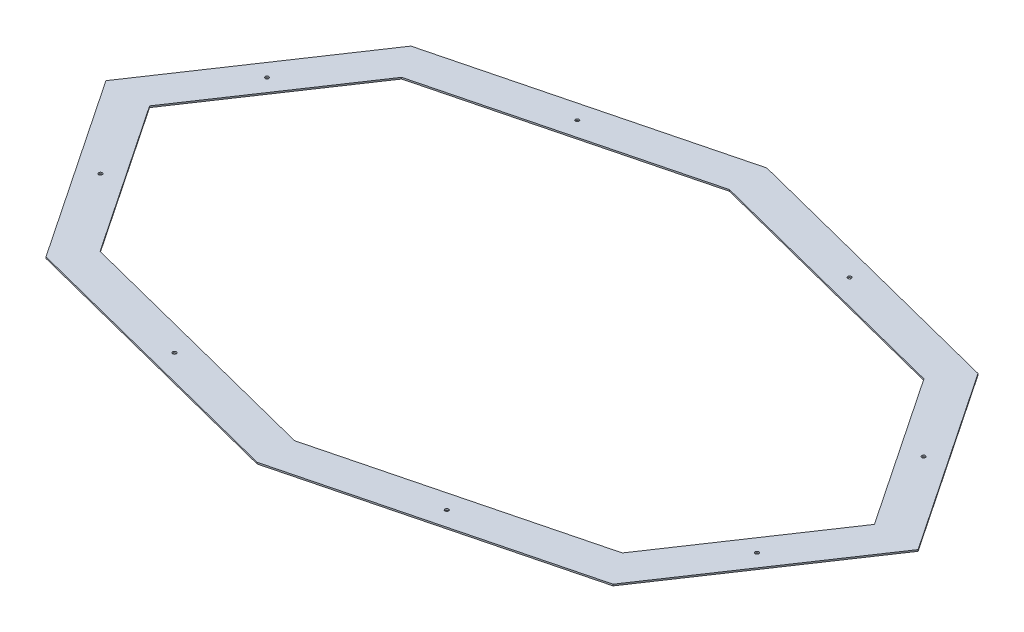
ISO-10303-21;
HEADER;
FILE_DESCRIPTION(('STEP AP214'),'2;1');
FILE_NAME('part.step','',(''),(''),'','','');
FILE_SCHEMA(('AUTOMOTIVE_DESIGN { 1 0 10303 214 1 1 1 1 }'));
ENDSEC;
DATA;
#1=APPLICATION_CONTEXT('core data for automotive mechanical design processes');
#2=APPLICATION_PROTOCOL_DEFINITION('international standard','automotive_design',2000,#1);
#3=PRODUCT_CONTEXT('',#1,'mechanical');
#4=PRODUCT('Part','Part','',(#3));
#5=PRODUCT_RELATED_PRODUCT_CATEGORY('part','',(#4));
#6=PRODUCT_DEFINITION_FORMATION('','',#4);
#7=PRODUCT_DEFINITION_CONTEXT('part definition',#1,'design');
#8=PRODUCT_DEFINITION('design','',#6,#7);
#9=PRODUCT_DEFINITION_SHAPE('','',#8);
#10=(LENGTH_UNIT() NAMED_UNIT(*) SI_UNIT(.MILLI.,.METRE.));
#11=(NAMED_UNIT(*) PLANE_ANGLE_UNIT() SI_UNIT($,.RADIAN.));
#12=(NAMED_UNIT(*) SI_UNIT($,.STERADIAN.) SOLID_ANGLE_UNIT());
#13=UNCERTAINTY_MEASURE_WITH_UNIT(LENGTH_MEASURE(1.E-05),#10,'distance_accuracy_value','');
#14=(GEOMETRIC_REPRESENTATION_CONTEXT(3) GLOBAL_UNCERTAINTY_ASSIGNED_CONTEXT((#13)) GLOBAL_UNIT_ASSIGNED_CONTEXT((#10,
#11,#12)) REPRESENTATION_CONTEXT('',''));
#15=CARTESIAN_POINT('',(0.,0.,0.));
#16=DIRECTION('',(0.,0.,1.));
#17=DIRECTION('',(1.,0.,0.));
#18=AXIS2_PLACEMENT_3D('',#15,#16,#17);
#19=CARTESIAN_POINT('',(0.,1.5875,0.));
#20=DIRECTION('',(0.,-1.,0.));
#21=DIRECTION('',(0.,0.,-1.));
#22=AXIS2_PLACEMENT_3D('',#19,#20,#21);
#23=PLANE('',#22);
#24=CARTESIAN_POINT('',(-286.298886633003,1.5875,423.425472391245));
#25=DIRECTION('',(0.,1.,0.));
#26=DIRECTION('',(0.,0.,1.));
#27=AXIS2_PLACEMENT_3D('',#24,#25,#26);
#28=CIRCLE('',#27,3.80999999999998);
#29=CARTESIAN_POINT('',(-286.298886633003,1.5875,427.235472391245));
#30=VERTEX_POINT('',#29);
#31=EDGE_CURVE('E399',#30,#30,#28,.T.);
#32=ORIENTED_EDGE('',*,*,#31,.F.);
#33=EDGE_LOOP('',(#32));
#34=FACE_BOUND('',#33,.T.);
#35=CARTESIAN_POINT('',(286.298886633004,1.5875,423.425472391245));
#36=DIRECTION('',(0.,1.,0.));
#37=DIRECTION('',(0.,0.,1.));
#38=AXIS2_PLACEMENT_3D('',#35,#36,#37);
#39=CIRCLE('',#38,3.80999999999998);
#40=CARTESIAN_POINT('',(286.298886633004,1.5875,427.235472391245));
#41=VERTEX_POINT('',#40);
#42=EDGE_CURVE('E401',#41,#41,#39,.T.);
#43=ORIENTED_EDGE('',*,*,#42,.F.);
#44=EDGE_LOOP('',(#43));
#45=FACE_BOUND('',#44,.T.);
#46=CARTESIAN_POINT('',(286.298886633003,1.5875,-423.425472391245));
#47=DIRECTION('',(0.,1.,0.));
#48=DIRECTION('',(0.,0.,1.));
#49=AXIS2_PLACEMENT_3D('',#46,#47,#48);
#50=CIRCLE('',#49,3.80999999999998);
#51=CARTESIAN_POINT('',(286.298886633003,1.5875,-419.615472391245));
#52=VERTEX_POINT('',#51);
#53=EDGE_CURVE('E409',#52,#52,#50,.T.);
#54=ORIENTED_EDGE('',*,*,#53,.F.);
#55=EDGE_LOOP('',(#54));
#56=FACE_BOUND('',#55,.T.);
#57=CARTESIAN_POINT('',(-286.298886633004,1.5875,-423.425472391246));
#58=DIRECTION('',(0.,1.,0.));
#59=DIRECTION('',(0.,0.,1.));
#60=AXIS2_PLACEMENT_3D('',#57,#58,#59);
#61=CIRCLE('',#60,3.80999999999998);
#62=CARTESIAN_POINT('',(-286.298886633004,1.5875,-419.615472391246));
#63=VERTEX_POINT('',#62);
#64=EDGE_CURVE('E415',#63,#63,#61,.T.);
#65=ORIENTED_EDGE('',*,*,#64,.F.);
#66=EDGE_LOOP('',(#65));
#67=FACE_BOUND('',#66,.T.);
#68=CARTESIAN_POINT('',(-690.246932704836,1.5875,-175.164374230963));
#69=DIRECTION('',(0.,1.,0.));
#70=DIRECTION('',(0.,0.,1.));
#71=AXIS2_PLACEMENT_3D('',#68,#69,#70);
#72=CIRCLE('',#71,3.80999999999998);
#73=CARTESIAN_POINT('',(-690.246932704836,1.5875,-171.354374230964));
#74=VERTEX_POINT('',#73);
#75=EDGE_CURVE('E421',#74,#74,#72,.T.);
#76=ORIENTED_EDGE('',*,*,#75,.F.);
#77=EDGE_LOOP('',(#76));
#78=FACE_BOUND('',#77,.T.);
#79=CARTESIAN_POINT('',(-690.246932704836,1.5875,175.164374230963));
#80=DIRECTION('',(0.,1.,0.));
#81=DIRECTION('',(0.,0.,1.));
#82=AXIS2_PLACEMENT_3D('',#79,#80,#81);
#83=CIRCLE('',#82,3.80999999999998);
#84=CARTESIAN_POINT('',(-690.246932704836,1.5875,178.974374230963));
#85=VERTEX_POINT('',#84);
#86=EDGE_CURVE('E427',#85,#85,#83,.T.);
#87=ORIENTED_EDGE('',*,*,#86,.F.);
#88=EDGE_LOOP('',(#87));
#89=FACE_BOUND('',#88,.T.);
#90=CARTESIAN_POINT('',(690.246932704837,1.5875,175.164374230964));
#91=DIRECTION('',(0.,1.,0.));
#92=DIRECTION('',(0.,0.,1.));
#93=AXIS2_PLACEMENT_3D('',#90,#91,#92);
#94=CIRCLE('',#93,3.80999999999998);
#95=CARTESIAN_POINT('',(690.246932704837,1.5875,178.974374230964));
#96=VERTEX_POINT('',#95);
#97=EDGE_CURVE('E433',#96,#96,#94,.T.);
#98=ORIENTED_EDGE('',*,*,#97,.F.);
#99=EDGE_LOOP('',(#98));
#100=FACE_BOUND('',#99,.T.);
#101=CARTESIAN_POINT('',(690.246932704837,1.5875,-175.164374230963));
#102=DIRECTION('',(0.,1.,0.));
#103=DIRECTION('',(0.,0.,1.));
#104=AXIS2_PLACEMENT_3D('',#101,#102,#103);
#105=CIRCLE('',#104,3.80999999999998);
#106=CARTESIAN_POINT('',(690.246932704837,1.5875,-171.354374230963));
#107=VERTEX_POINT('',#106);
#108=EDGE_CURVE('E439',#107,#107,#105,.T.);
#109=ORIENTED_EDGE('',*,*,#108,.F.);
#110=EDGE_LOOP('',(#109));
#111=FACE_BOUND('',#110,.T.);
#112=DIRECTION('',(-0.557560904059293,0.,0.830136035999272));
#113=VECTOR('',#112,1.);
#114=CARTESIAN_POINT('',(-853.792184287332,1.5875,-2.15105711021124E-13));
#115=LINE('',#114,#113);
#116=CARTESIAN_POINT('',(-596.116107134367,1.5875,-383.646334781136));
#117=VERTEX_POINT('',#116);
#118=CARTESIAN_POINT('',(-853.792184287332,1.5875,-2.15105711021124E-13));
#119=VERTEX_POINT('',#118);
#120=EDGE_CURVE('E215',#117,#119,#115,.T.);
#121=ORIENTED_EDGE('',*,*,#120,.T.);
#122=DIRECTION('',(0.557560904059292,0.,0.830136035999272));
#123=VECTOR('',#122,1.);
#124=CARTESIAN_POINT('',(-853.792184287332,1.5875,-2.15105711021124E-13));
#125=LINE('',#124,#123);
#126=CARTESIAN_POINT('',(-596.116107134367,1.5875,383.646334781137));
#127=VERTEX_POINT('',#126);
#128=EDGE_CURVE('E218',#119,#127,#125,.T.);
#129=ORIENTED_EDGE('',*,*,#128,.T.);
#130=DIRECTION('',(0.968918411611585,0.,0.247380499716696));
#131=VECTOR('',#130,1.);
#132=CARTESIAN_POINT('',(-1.90819582357449E-13,1.5875,535.844392641128));
#133=LINE('',#132,#131);
#134=CARTESIAN_POINT('',(-1.90819582357449E-13,1.5875,535.844392641128));
#135=VERTEX_POINT('',#134);
#136=EDGE_CURVE('E221',#127,#135,#133,.T.);
#137=ORIENTED_EDGE('',*,*,#136,.T.);
#138=DIRECTION('',(0.968918411611586,0.,-0.247380499716696));
#139=VECTOR('',#138,1.);
#140=CARTESIAN_POINT('',(596.116107134367,1.5875,383.646334781136));
#141=LINE('',#140,#139);
#142=CARTESIAN_POINT('',(596.116107134367,1.5875,383.646334781136));
#143=VERTEX_POINT('',#142);
#144=EDGE_CURVE('E223',#135,#143,#141,.T.);
#145=ORIENTED_EDGE('',*,*,#144,.T.);
#146=DIRECTION('',(0.557560904059293,0.,-0.830136035999272));
#147=VECTOR('',#146,1.);
#148=CARTESIAN_POINT('',(853.792184287331,1.5875,1.31838984174237E-13));
#149=LINE('',#148,#147);
#150=CARTESIAN_POINT('',(853.792184287331,1.5875,1.31838984174237E-13));
#151=VERTEX_POINT('',#150);
#152=EDGE_CURVE('E225',#143,#151,#149,.T.);
#153=ORIENTED_EDGE('',*,*,#152,.T.);
#154=DIRECTION('',(-0.557560904059293,0.,-0.830136035999272));
#155=VECTOR('',#154,1.);
#156=CARTESIAN_POINT('',(596.116107134367,1.5875,-383.646334781136));
#157=LINE('',#156,#155);
#158=CARTESIAN_POINT('',(596.116107134367,1.5875,-383.646334781136));
#159=VERTEX_POINT('',#158);
#160=EDGE_CURVE('E227',#151,#159,#157,.T.);
#161=ORIENTED_EDGE('',*,*,#160,.T.);
#162=DIRECTION('',(-0.968918411611585,0.,-0.247380499716696));
#163=VECTOR('',#162,1.);
#164=CARTESIAN_POINT('',(1.59594559789866E-13,1.5875,-535.844392641128));
#165=LINE('',#164,#163);
#166=CARTESIAN_POINT('',(1.59594559789866E-13,1.5875,-535.844392641128));
#167=VERTEX_POINT('',#166);
#168=EDGE_CURVE('E229',#159,#167,#165,.T.);
#169=ORIENTED_EDGE('',*,*,#168,.T.);
#170=DIRECTION('',(-0.968918411611585,0.,0.247380499716696));
#171=VECTOR('',#170,1.);
#172=CARTESIAN_POINT('',(-596.116107134367,1.5875,-383.646334781136));
#173=LINE('',#172,#171);
#174=EDGE_CURVE('E231',#167,#117,#173,.T.);
#175=ORIENTED_EDGE('',*,*,#174,.T.);
#176=EDGE_LOOP('',(#121,#129,#137,#145,#153,#161,#169,#175));
#177=FACE_BOUND('',#176,.T.);
#178=DIRECTION('',(-0.968918411611585,0.,0.247380499716696));
#179=VECTOR('',#178,1.);
#180=CARTESIAN_POINT('',(-549.079439397647,1.5875,-317.011162142716));
#181=LINE('',#180,#179);
#182=CARTESIAN_POINT('',(0.,1.5875,-457.2));
#183=VERTEX_POINT('',#182);
#184=CARTESIAN_POINT('',(-549.079439397647,1.5875,-317.011162142716));
#185=VERTEX_POINT('',#184);
#186=EDGE_CURVE('E148',#183,#185,#181,.T.);
#187=ORIENTED_EDGE('',*,*,#186,.F.);
#188=DIRECTION('',(-0.968918411611586,0.,-0.247380499716696));
#189=VECTOR('',#188,1.);
#190=CARTESIAN_POINT('',(0.,1.5875,-457.2));
#191=LINE('',#190,#189);
#192=CARTESIAN_POINT('',(549.079439397648,1.5875,-317.011162142716));
#193=VERTEX_POINT('',#192);
#194=EDGE_CURVE('E182',#193,#183,#191,.T.);
#195=ORIENTED_EDGE('',*,*,#194,.F.);
#196=DIRECTION('',(-0.557560904059292,0.,-0.830136035999272));
#197=VECTOR('',#196,1.);
#198=CARTESIAN_POINT('',(549.079439397648,1.5875,-317.011162142716));
#199=LINE('',#198,#197);
#200=CARTESIAN_POINT('',(762.,1.5875,0.));
#201=VERTEX_POINT('',#200);
#202=EDGE_CURVE('E180',#201,#193,#199,.T.);
#203=ORIENTED_EDGE('',*,*,#202,.F.);
#204=DIRECTION('',(0.557560904059292,0.,-0.830136035999272));
#205=VECTOR('',#204,1.);
#206=CARTESIAN_POINT('',(762.,1.5875,0.));
#207=LINE('',#206,#205);
#208=CARTESIAN_POINT('',(549.079439397648,1.5875,317.011162142716));
#209=VERTEX_POINT('',#208);
#210=EDGE_CURVE('E178',#209,#201,#207,.T.);
#211=ORIENTED_EDGE('',*,*,#210,.F.);
#212=DIRECTION('',(0.968918411611586,0.,-0.247380499716696));
#213=VECTOR('',#212,1.);
#214=CARTESIAN_POINT('',(549.079439397648,1.5875,317.011162142716));
#215=LINE('',#214,#213);
#216=CARTESIAN_POINT('',(0.,1.5875,457.2));
#217=VERTEX_POINT('',#216);
#218=EDGE_CURVE('E176',#217,#209,#215,.T.);
#219=ORIENTED_EDGE('',*,*,#218,.F.);
#220=DIRECTION('',(0.968918411611585,0.,0.247380499716696));
#221=VECTOR('',#220,1.);
#222=CARTESIAN_POINT('',(0.,1.5875,457.2));
#223=LINE('',#222,#221);
#224=CARTESIAN_POINT('',(-549.079439397647,1.5875,317.011162142716));
#225=VERTEX_POINT('',#224);
#226=EDGE_CURVE('E171',#225,#217,#223,.T.);
#227=ORIENTED_EDGE('',*,*,#226,.F.);
#228=DIRECTION('',(0.557560904059293,0.,0.830136035999271));
#229=VECTOR('',#228,1.);
#230=CARTESIAN_POINT('',(-762.,1.5875,0.));
#231=LINE('',#230,#229);
#232=CARTESIAN_POINT('',(-762.,1.5875,0.));
#233=VERTEX_POINT('',#232);
#234=EDGE_CURVE('E169',#233,#225,#231,.T.);
#235=ORIENTED_EDGE('',*,*,#234,.F.);
#236=DIRECTION('',(-0.557560904059293,0.,0.830136035999272));
#237=VECTOR('',#236,1.);
#238=CARTESIAN_POINT('',(-762.,1.5875,0.));
#239=LINE('',#238,#237);
#240=EDGE_CURVE('E156',#185,#233,#239,.T.);
#241=ORIENTED_EDGE('',*,*,#240,.F.);
#242=EDGE_LOOP('',(#187,#195,#203,#211,#219,#227,#235,#241));
#243=FACE_BOUND('',#242,.T.);
#244=ADVANCED_FACE('F35',(#34,#45,#56,#67,#78,#89,#100,#111,#177,#243),#23,.F.);
#245=CARTESIAN_POINT('',(0.,-1.5875,0.));
#246=DIRECTION('',(0.,-1.,0.));
#247=DIRECTION('',(0.,0.,-1.));
#248=AXIS2_PLACEMENT_3D('',#245,#246,#247);
#249=PLANE('',#248);
#250=CARTESIAN_POINT('',(-286.298886633003,-1.5875,423.425472391245));
#251=DIRECTION('',(0.,1.,0.));
#252=DIRECTION('',(0.,0.,1.));
#253=AXIS2_PLACEMENT_3D('',#250,#251,#252);
#254=CIRCLE('',#253,3.80999999999998);
#255=CARTESIAN_POINT('',(-286.298886633003,-1.5875,427.235472391245));
#256=VERTEX_POINT('',#255);
#257=EDGE_CURVE('E397',#256,#256,#254,.T.);
#258=ORIENTED_EDGE('',*,*,#257,.T.);
#259=EDGE_LOOP('',(#258));
#260=FACE_BOUND('',#259,.T.);
#261=CARTESIAN_POINT('',(286.298886633004,-1.5875,423.425472391245));
#262=DIRECTION('',(0.,1.,0.));
#263=DIRECTION('',(0.,0.,1.));
#264=AXIS2_PLACEMENT_3D('',#261,#262,#263);
#265=CIRCLE('',#264,3.80999999999998);
#266=CARTESIAN_POINT('',(286.298886633004,-1.5875,427.235472391245));
#267=VERTEX_POINT('',#266);
#268=EDGE_CURVE('E406',#267,#267,#265,.T.);
#269=ORIENTED_EDGE('',*,*,#268,.T.);
#270=EDGE_LOOP('',(#269));
#271=FACE_BOUND('',#270,.T.);
#272=CARTESIAN_POINT('',(286.298886633003,-1.5875,-423.425472391245));
#273=DIRECTION('',(0.,1.,0.));
#274=DIRECTION('',(0.,0.,1.));
#275=AXIS2_PLACEMENT_3D('',#272,#273,#274);
#276=CIRCLE('',#275,3.80999999999998);
#277=CARTESIAN_POINT('',(286.298886633003,-1.5875,-419.615472391245));
#278=VERTEX_POINT('',#277);
#279=EDGE_CURVE('E412',#278,#278,#276,.T.);
#280=ORIENTED_EDGE('',*,*,#279,.T.);
#281=EDGE_LOOP('',(#280));
#282=FACE_BOUND('',#281,.T.);
#283=CARTESIAN_POINT('',(-286.298886633004,-1.5875,-423.425472391246));
#284=DIRECTION('',(0.,1.,0.));
#285=DIRECTION('',(0.,0.,1.));
#286=AXIS2_PLACEMENT_3D('',#283,#284,#285);
#287=CIRCLE('',#286,3.80999999999998);
#288=CARTESIAN_POINT('',(-286.298886633004,-1.5875,-419.615472391246));
#289=VERTEX_POINT('',#288);
#290=EDGE_CURVE('E418',#289,#289,#287,.T.);
#291=ORIENTED_EDGE('',*,*,#290,.T.);
#292=EDGE_LOOP('',(#291));
#293=FACE_BOUND('',#292,.T.);
#294=CARTESIAN_POINT('',(-690.246932704836,-1.5875,-175.164374230963));
#295=DIRECTION('',(0.,1.,0.));
#296=DIRECTION('',(0.,0.,1.));
#297=AXIS2_PLACEMENT_3D('',#294,#295,#296);
#298=CIRCLE('',#297,3.80999999999998);
#299=CARTESIAN_POINT('',(-690.246932704836,-1.5875,-171.354374230964));
#300=VERTEX_POINT('',#299);
#301=EDGE_CURVE('E424',#300,#300,#298,.T.);
#302=ORIENTED_EDGE('',*,*,#301,.T.);
#303=EDGE_LOOP('',(#302));
#304=FACE_BOUND('',#303,.T.);
#305=CARTESIAN_POINT('',(-690.246932704836,-1.5875,175.164374230963));
#306=DIRECTION('',(0.,1.,0.));
#307=DIRECTION('',(0.,0.,1.));
#308=AXIS2_PLACEMENT_3D('',#305,#306,#307);
#309=CIRCLE('',#308,3.80999999999998);
#310=CARTESIAN_POINT('',(-690.246932704836,-1.5875,178.974374230963));
#311=VERTEX_POINT('',#310);
#312=EDGE_CURVE('E430',#311,#311,#309,.T.);
#313=ORIENTED_EDGE('',*,*,#312,.T.);
#314=EDGE_LOOP('',(#313));
#315=FACE_BOUND('',#314,.T.);
#316=CARTESIAN_POINT('',(690.246932704837,-1.5875,175.164374230964));
#317=DIRECTION('',(0.,1.,0.));
#318=DIRECTION('',(0.,0.,1.));
#319=AXIS2_PLACEMENT_3D('',#316,#317,#318);
#320=CIRCLE('',#319,3.80999999999998);
#321=CARTESIAN_POINT('',(690.246932704837,-1.5875,178.974374230964));
#322=VERTEX_POINT('',#321);
#323=EDGE_CURVE('E436',#322,#322,#320,.T.);
#324=ORIENTED_EDGE('',*,*,#323,.T.);
#325=EDGE_LOOP('',(#324));
#326=FACE_BOUND('',#325,.T.);
#327=CARTESIAN_POINT('',(690.246932704837,-1.5875,-175.164374230963));
#328=DIRECTION('',(0.,1.,0.));
#329=DIRECTION('',(0.,0.,1.));
#330=AXIS2_PLACEMENT_3D('',#327,#328,#329);
#331=CIRCLE('',#330,3.80999999999998);
#332=CARTESIAN_POINT('',(690.246932704837,-1.5875,-171.354374230963));
#333=VERTEX_POINT('',#332);
#334=EDGE_CURVE('E185',#333,#333,#331,.T.);
#335=ORIENTED_EDGE('',*,*,#334,.T.);
#336=EDGE_LOOP('',(#335));
#337=FACE_BOUND('',#336,.T.);
#338=DIRECTION('',(-0.557560904059293,0.,0.830136035999272));
#339=VECTOR('',#338,1.);
#340=CARTESIAN_POINT('',(-853.792184287332,-1.5875,-2.15105711021124E-13));
#341=LINE('',#340,#339);
#342=CARTESIAN_POINT('',(-596.116107134367,-1.5875,-383.646334781136));
#343=VERTEX_POINT('',#342);
#344=CARTESIAN_POINT('',(-853.792184287332,-1.5875,-2.15105711021124E-13));
#345=VERTEX_POINT('',#344);
#346=EDGE_CURVE('E164',#343,#345,#341,.T.);
#347=ORIENTED_EDGE('',*,*,#346,.F.);
#348=DIRECTION('',(-0.968918411611585,0.,0.247380499716696));
#349=VECTOR('',#348,1.);
#350=CARTESIAN_POINT('',(-596.116107134367,-1.5875,-383.646334781136));
#351=LINE('',#350,#349);
#352=CARTESIAN_POINT('',(1.59594559789866E-13,-1.5875,-535.844392641128));
#353=VERTEX_POINT('',#352);
#354=EDGE_CURVE('E219',#353,#343,#351,.T.);
#355=ORIENTED_EDGE('',*,*,#354,.F.);
#356=DIRECTION('',(-0.968918411611585,0.,-0.247380499716696));
#357=VECTOR('',#356,1.);
#358=CARTESIAN_POINT('',(1.59594559789866E-13,-1.5875,-535.844392641128));
#359=LINE('',#358,#357);
#360=CARTESIAN_POINT('',(596.116107134367,-1.5875,-383.646334781136));
#361=VERTEX_POINT('',#360);
#362=EDGE_CURVE('E246',#361,#353,#359,.T.);
#363=ORIENTED_EDGE('',*,*,#362,.F.);
#364=DIRECTION('',(-0.557560904059293,0.,-0.830136035999272));
#365=VECTOR('',#364,1.);
#366=CARTESIAN_POINT('',(596.116107134367,-1.5875,-383.646334781136));
#367=LINE('',#366,#365);
#368=CARTESIAN_POINT('',(853.792184287331,-1.5875,1.31838984174237E-13));
#369=VERTEX_POINT('',#368);
#370=EDGE_CURVE('E244',#369,#361,#367,.T.);
#371=ORIENTED_EDGE('',*,*,#370,.F.);
#372=DIRECTION('',(0.557560904059293,0.,-0.830136035999272));
#373=VECTOR('',#372,1.);
#374=CARTESIAN_POINT('',(853.792184287331,-1.5875,1.31838984174237E-13));
#375=LINE('',#374,#373);
#376=CARTESIAN_POINT('',(596.116107134367,-1.5875,383.646334781136));
#377=VERTEX_POINT('',#376);
#378=EDGE_CURVE('E242',#377,#369,#375,.T.);
#379=ORIENTED_EDGE('',*,*,#378,.F.);
#380=DIRECTION('',(0.968918411611586,0.,-0.247380499716696));
#381=VECTOR('',#380,1.);
#382=CARTESIAN_POINT('',(596.116107134367,-1.5875,383.646334781136));
#383=LINE('',#382,#381);
#384=CARTESIAN_POINT('',(-1.90819582357449E-13,-1.5875,535.844392641128));
#385=VERTEX_POINT('',#384);
#386=EDGE_CURVE('E240',#385,#377,#383,.T.);
#387=ORIENTED_EDGE('',*,*,#386,.F.);
#388=DIRECTION('',(0.968918411611585,0.,0.247380499716696));
#389=VECTOR('',#388,1.);
#390=CARTESIAN_POINT('',(-1.90819582357449E-13,-1.5875,535.844392641128));
#391=LINE('',#390,#389);
#392=CARTESIAN_POINT('',(-596.116107134367,-1.5875,383.646334781137));
#393=VERTEX_POINT('',#392);
#394=EDGE_CURVE('E238',#393,#385,#391,.T.);
#395=ORIENTED_EDGE('',*,*,#394,.F.);
#396=DIRECTION('',(0.557560904059292,0.,0.830136035999272));
#397=VECTOR('',#396,1.);
#398=CARTESIAN_POINT('',(-853.792184287332,-1.5875,-2.15105711021124E-13));
#399=LINE('',#398,#397);
#400=EDGE_CURVE('E236',#345,#393,#399,.T.);
#401=ORIENTED_EDGE('',*,*,#400,.F.);
#402=EDGE_LOOP('',(#347,#355,#363,#371,#379,#387,#395,#401));
#403=FACE_BOUND('',#402,.T.);
#404=DIRECTION('',(-0.968918411611586,0.,-0.247380499716696));
#405=VECTOR('',#404,1.);
#406=CARTESIAN_POINT('',(0.,-1.5875,-457.2));
#407=LINE('',#406,#405);
#408=CARTESIAN_POINT('',(549.079439397648,-1.5875,-317.011162142716));
#409=VERTEX_POINT('',#408);
#410=CARTESIAN_POINT('',(0.,-1.5875,-457.2));
#411=VERTEX_POINT('',#410);
#412=EDGE_CURVE('E157',#409,#411,#407,.T.);
#413=ORIENTED_EDGE('',*,*,#412,.T.);
#414=DIRECTION('',(-0.968918411611585,0.,0.247380499716696));
#415=VECTOR('',#414,1.);
#416=CARTESIAN_POINT('',(-549.079439397647,-1.5875,-317.011162142716));
#417=LINE('',#416,#415);
#418=CARTESIAN_POINT('',(-549.079439397647,-1.5875,-317.011162142716));
#419=VERTEX_POINT('',#418);
#420=EDGE_CURVE('E58',#411,#419,#417,.T.);
#421=ORIENTED_EDGE('',*,*,#420,.T.);
#422=DIRECTION('',(-0.557560904059293,0.,0.830136035999272));
#423=VECTOR('',#422,1.);
#424=CARTESIAN_POINT('',(-762.,-1.5875,0.));
#425=LINE('',#424,#423);
#426=CARTESIAN_POINT('',(-762.,-1.5875,0.));
#427=VERTEX_POINT('',#426);
#428=EDGE_CURVE('E163',#419,#427,#425,.T.);
#429=ORIENTED_EDGE('',*,*,#428,.T.);
#430=DIRECTION('',(0.557560904059293,0.,0.830136035999271));
#431=VECTOR('',#430,1.);
#432=CARTESIAN_POINT('',(-762.,-1.5875,0.));
#433=LINE('',#432,#431);
#434=CARTESIAN_POINT('',(-549.079439397647,-1.5875,317.011162142716));
#435=VERTEX_POINT('',#434);
#436=EDGE_CURVE('E187',#427,#435,#433,.T.);
#437=ORIENTED_EDGE('',*,*,#436,.T.);
#438=DIRECTION('',(0.968918411611585,0.,0.247380499716696));
#439=VECTOR('',#438,1.);
#440=CARTESIAN_POINT('',(0.,-1.5875,457.2));
#441=LINE('',#440,#439);
#442=CARTESIAN_POINT('',(0.,-1.5875,457.2));
#443=VERTEX_POINT('',#442);
#444=EDGE_CURVE('E190',#435,#443,#441,.T.);
#445=ORIENTED_EDGE('',*,*,#444,.T.);
#446=DIRECTION('',(0.968918411611586,0.,-0.247380499716696));
#447=VECTOR('',#446,1.);
#448=CARTESIAN_POINT('',(549.079439397648,-1.5875,317.011162142716));
#449=LINE('',#448,#447);
#450=CARTESIAN_POINT('',(549.079439397648,-1.5875,317.011162142716));
#451=VERTEX_POINT('',#450);
#452=EDGE_CURVE('E193',#443,#451,#449,.T.);
#453=ORIENTED_EDGE('',*,*,#452,.T.);
#454=DIRECTION('',(0.557560904059292,0.,-0.830136035999272));
#455=VECTOR('',#454,1.);
#456=CARTESIAN_POINT('',(762.,-1.5875,0.));
#457=LINE('',#456,#455);
#458=CARTESIAN_POINT('',(762.,-1.5875,0.));
#459=VERTEX_POINT('',#458);
#460=EDGE_CURVE('E196',#451,#459,#457,.T.);
#461=ORIENTED_EDGE('',*,*,#460,.T.);
#462=DIRECTION('',(-0.557560904059292,0.,-0.830136035999272));
#463=VECTOR('',#462,1.);
#464=CARTESIAN_POINT('',(549.079439397648,-1.5875,-317.011162142716));
#465=LINE('',#464,#463);
#466=EDGE_CURVE('E199',#459,#409,#465,.T.);
#467=ORIENTED_EDGE('',*,*,#466,.T.);
#468=EDGE_LOOP('',(#413,#421,#429,#437,#445,#453,#461,#467));
#469=FACE_BOUND('',#468,.T.);
#470=ADVANCED_FACE('F276',(#260,#271,#282,#293,#304,#315,#326,#337,#403,#469),#249,.T.);
#471=CARTESIAN_POINT('',(-853.792184287332,1.5875,-2.15105711021124E-13));
#472=DIRECTION('',(0.830136035999272,0.,0.557560904059293));
#473=DIRECTION('',(0.557560904059293,0.,-0.830136035999272));
#474=AXIS2_PLACEMENT_3D('',#471,#472,#473);
#475=PLANE('',#474);
#476=ORIENTED_EDGE('',*,*,#346,.T.);
#477=DIRECTION('',(0.,-1.,0.));
#478=VECTOR('',#477,1.);
#479=CARTESIAN_POINT('',(-853.792184287332,1.5875,-2.15105711021124E-13));
#480=LINE('',#479,#478);
#481=EDGE_CURVE('E11',#119,#345,#480,.T.);
#482=ORIENTED_EDGE('',*,*,#481,.F.);
#483=ORIENTED_EDGE('',*,*,#120,.F.);
#484=DIRECTION('',(0.,-1.,0.));
#485=VECTOR('',#484,1.);
#486=CARTESIAN_POINT('',(-596.116107134367,1.5875,-383.646334781136));
#487=LINE('',#486,#485);
#488=EDGE_CURVE('E233',#117,#343,#487,.T.);
#489=ORIENTED_EDGE('',*,*,#488,.T.);
#490=EDGE_LOOP('',(#476,#482,#483,#489));
#491=FACE_BOUND('',#490,.T.);
#492=ADVANCED_FACE('F37',(#491),#475,.F.);
#493=CARTESIAN_POINT('',(-853.792184287332,1.5875,-2.15105711021124E-13));
#494=DIRECTION('',(0.830136035999272,0.,-0.557560904059292));
#495=DIRECTION('',(-0.557560904059292,0.,-0.830136035999272));
#496=AXIS2_PLACEMENT_3D('',#493,#494,#495);
#497=PLANE('',#496);
#498=ORIENTED_EDGE('',*,*,#400,.T.);
#499=DIRECTION('',(0.,-1.,0.));
#500=VECTOR('',#499,1.);
#501=CARTESIAN_POINT('',(-596.116107134367,1.5875,383.646334781137));
#502=LINE('',#501,#500);
#503=EDGE_CURVE('E43',#127,#393,#502,.T.);
#504=ORIENTED_EDGE('',*,*,#503,.F.);
#505=ORIENTED_EDGE('',*,*,#128,.F.);
#506=ORIENTED_EDGE('',*,*,#481,.T.);
#507=EDGE_LOOP('',(#498,#504,#505,#506));
#508=FACE_BOUND('',#507,.T.);
#509=ADVANCED_FACE('F293',(#508),#497,.F.);
#510=CARTESIAN_POINT('',(-1.90819582357449E-13,1.5875,535.844392641128));
#511=DIRECTION('',(0.247380499716696,0.,-0.968918411611585));
#512=DIRECTION('',(-0.968918411611586,0.,-0.247380499716696));
#513=AXIS2_PLACEMENT_3D('',#510,#511,#512);
#514=PLANE('',#513);
#515=ORIENTED_EDGE('',*,*,#394,.T.);
#516=DIRECTION('',(0.,-1.,0.));
#517=VECTOR('',#516,1.);
#518=CARTESIAN_POINT('',(-1.90819582357449E-13,1.5875,535.844392641128));
#519=LINE('',#518,#517);
#520=EDGE_CURVE('E263',#135,#385,#519,.T.);
#521=ORIENTED_EDGE('',*,*,#520,.F.);
#522=ORIENTED_EDGE('',*,*,#136,.F.);
#523=ORIENTED_EDGE('',*,*,#503,.T.);
#524=EDGE_LOOP('',(#515,#521,#522,#523));
#525=FACE_BOUND('',#524,.T.);
#526=ADVANCED_FACE('F270',(#525),#514,.F.);
#527=CARTESIAN_POINT('',(596.116107134367,1.5875,383.646334781136));
#528=DIRECTION('',(-0.247380499716696,0.,-0.968918411611585));
#529=DIRECTION('',(-0.968918411611586,0.,0.247380499716696));
#530=AXIS2_PLACEMENT_3D('',#527,#528,#529);
#531=PLANE('',#530);
#532=ORIENTED_EDGE('',*,*,#386,.T.);
#533=DIRECTION('',(0.,-1.,0.));
#534=VECTOR('',#533,1.);
#535=CARTESIAN_POINT('',(596.116107134367,1.5875,383.646334781136));
#536=LINE('',#535,#534);
#537=EDGE_CURVE('E260',#143,#377,#536,.T.);
#538=ORIENTED_EDGE('',*,*,#537,.F.);
#539=ORIENTED_EDGE('',*,*,#144,.F.);
#540=ORIENTED_EDGE('',*,*,#520,.T.);
#541=EDGE_LOOP('',(#532,#538,#539,#540));
#542=FACE_BOUND('',#541,.T.);
#543=ADVANCED_FACE('F282',(#542),#531,.F.);
#544=CARTESIAN_POINT('',(853.792184287331,1.5875,1.31838984174237E-13));
#545=DIRECTION('',(-0.830136035999272,0.,-0.557560904059293));
#546=DIRECTION('',(-0.557560904059293,0.,0.830136035999272));
#547=AXIS2_PLACEMENT_3D('',#544,#545,#546);
#548=PLANE('',#547);
#549=ORIENTED_EDGE('',*,*,#378,.T.);
#550=DIRECTION('',(0.,-1.,0.));
#551=VECTOR('',#550,1.);
#552=CARTESIAN_POINT('',(853.792184287331,1.5875,1.31838984174237E-13));
#553=LINE('',#552,#551);
#554=EDGE_CURVE('E257',#151,#369,#553,.T.);
#555=ORIENTED_EDGE('',*,*,#554,.F.);
#556=ORIENTED_EDGE('',*,*,#152,.F.);
#557=ORIENTED_EDGE('',*,*,#537,.T.);
#558=EDGE_LOOP('',(#549,#555,#556,#557));
#559=FACE_BOUND('',#558,.T.);
#560=ADVANCED_FACE('F286',(#559),#548,.F.);
#561=CARTESIAN_POINT('',(596.116107134367,1.5875,-383.646334781136));
#562=DIRECTION('',(-0.830136035999272,0.,0.557560904059293));
#563=DIRECTION('',(0.557560904059293,0.,0.830136035999272));
#564=AXIS2_PLACEMENT_3D('',#561,#562,#563);
#565=PLANE('',#564);
#566=ORIENTED_EDGE('',*,*,#370,.T.);
#567=DIRECTION('',(0.,-1.,0.));
#568=VECTOR('',#567,1.);
#569=CARTESIAN_POINT('',(596.116107134367,1.5875,-383.646334781136));
#570=LINE('',#569,#568);
#571=EDGE_CURVE('E254',#159,#361,#570,.T.);
#572=ORIENTED_EDGE('',*,*,#571,.F.);
#573=ORIENTED_EDGE('',*,*,#160,.F.);
#574=ORIENTED_EDGE('',*,*,#554,.T.);
#575=EDGE_LOOP('',(#566,#572,#573,#574));
#576=FACE_BOUND('',#575,.T.);
#577=ADVANCED_FACE('F306',(#576),#565,.F.);
#578=CARTESIAN_POINT('',(1.59594559789866E-13,1.5875,-535.844392641128));
#579=DIRECTION('',(-0.247380499716696,0.,0.968918411611585));
#580=DIRECTION('',(0.968918411611586,0.,0.247380499716696));
#581=AXIS2_PLACEMENT_3D('',#578,#579,#580);
#582=PLANE('',#581);
#583=ORIENTED_EDGE('',*,*,#362,.T.);
#584=DIRECTION('',(0.,-1.,0.));
#585=VECTOR('',#584,1.);
#586=CARTESIAN_POINT('',(1.59594559789866E-13,1.5875,-535.844392641128));
#587=LINE('',#586,#585);
#588=EDGE_CURVE('E251',#167,#353,#587,.T.);
#589=ORIENTED_EDGE('',*,*,#588,.F.);
#590=ORIENTED_EDGE('',*,*,#168,.F.);
#591=ORIENTED_EDGE('',*,*,#571,.T.);
#592=EDGE_LOOP('',(#583,#589,#590,#591));
#593=FACE_BOUND('',#592,.T.);
#594=ADVANCED_FACE('F304',(#593),#582,.F.);
#595=CARTESIAN_POINT('',(-596.116107134367,1.5875,-383.646334781136));
#596=DIRECTION('',(0.247380499716696,0.,0.968918411611586));
#597=DIRECTION('',(0.968918411611586,0.,-0.247380499716696));
#598=AXIS2_PLACEMENT_3D('',#595,#596,#597);
#599=PLANE('',#598);
#600=ORIENTED_EDGE('',*,*,#354,.T.);
#601=ORIENTED_EDGE('',*,*,#488,.F.);
#602=ORIENTED_EDGE('',*,*,#174,.F.);
#603=ORIENTED_EDGE('',*,*,#588,.T.);
#604=EDGE_LOOP('',(#600,#601,#602,#603));
#605=FACE_BOUND('',#604,.T.);
#606=ADVANCED_FACE('F299',(#605),#599,.F.);
#607=CARTESIAN_POINT('',(-549.079439397647,1.5875,-317.011162142716));
#608=DIRECTION('',(0.247380499716696,0.,0.968918411611585));
#609=DIRECTION('',(0.968918411611586,0.,-0.247380499716696));
#610=AXIS2_PLACEMENT_3D('',#607,#608,#609);
#611=PLANE('',#610);
#612=ORIENTED_EDGE('',*,*,#420,.F.);
#613=DIRECTION('',(0.,-1.,0.));
#614=VECTOR('',#613,1.);
#615=CARTESIAN_POINT('',(0.,1.5875,-457.2));
#616=LINE('',#615,#614);
#617=EDGE_CURVE('E152',#183,#411,#616,.T.);
#618=ORIENTED_EDGE('',*,*,#617,.F.);
#619=ORIENTED_EDGE('',*,*,#186,.T.);
#620=DIRECTION('',(0.,-1.,0.));
#621=VECTOR('',#620,1.);
#622=CARTESIAN_POINT('',(-549.079439397647,1.5875,-317.011162142716));
#623=LINE('',#622,#621);
#624=EDGE_CURVE('E151',#185,#419,#623,.T.);
#625=ORIENTED_EDGE('',*,*,#624,.T.);
#626=EDGE_LOOP('',(#612,#618,#619,#625));
#627=FACE_BOUND('',#626,.T.);
#628=ADVANCED_FACE('F150',(#627),#611,.T.);
#629=CARTESIAN_POINT('',(-762.,1.5875,0.));
#630=DIRECTION('',(0.830136035999272,0.,0.557560904059293));
#631=DIRECTION('',(0.557560904059293,0.,-0.830136035999272));
#632=AXIS2_PLACEMENT_3D('',#629,#630,#631);
#633=PLANE('',#632);
#634=ORIENTED_EDGE('',*,*,#428,.F.);
#635=ORIENTED_EDGE('',*,*,#624,.F.);
#636=ORIENTED_EDGE('',*,*,#240,.T.);
#637=DIRECTION('',(0.,-1.,0.));
#638=VECTOR('',#637,1.);
#639=CARTESIAN_POINT('',(-762.,1.5875,0.));
#640=LINE('',#639,#638);
#641=EDGE_CURVE('E165',#233,#427,#640,.T.);
#642=ORIENTED_EDGE('',*,*,#641,.T.);
#643=EDGE_LOOP('',(#634,#635,#636,#642));
#644=FACE_BOUND('',#643,.T.);
#645=ADVANCED_FACE('F160',(#644),#633,.T.);
#646=CARTESIAN_POINT('',(-762.,1.5875,0.));
#647=DIRECTION('',(0.830136035999272,0.,-0.557560904059293));
#648=DIRECTION('',(-0.557560904059293,0.,-0.830136035999272));
#649=AXIS2_PLACEMENT_3D('',#646,#647,#648);
#650=PLANE('',#649);
#651=ORIENTED_EDGE('',*,*,#436,.F.);
#652=ORIENTED_EDGE('',*,*,#641,.F.);
#653=ORIENTED_EDGE('',*,*,#234,.T.);
#654=DIRECTION('',(0.,-1.,0.));
#655=VECTOR('',#654,1.);
#656=CARTESIAN_POINT('',(-549.079439397647,1.5875,317.011162142716));
#657=LINE('',#656,#655);
#658=EDGE_CURVE('E212',#225,#435,#657,.T.);
#659=ORIENTED_EDGE('',*,*,#658,.T.);
#660=EDGE_LOOP('',(#651,#652,#653,#659));
#661=FACE_BOUND('',#660,.T.);
#662=ADVANCED_FACE('F335',(#661),#650,.T.);
#663=CARTESIAN_POINT('',(0.,1.5875,457.2));
#664=DIRECTION('',(0.247380499716696,0.,-0.968918411611585));
#665=DIRECTION('',(-0.968918411611586,0.,-0.247380499716696));
#666=AXIS2_PLACEMENT_3D('',#663,#664,#665);
#667=PLANE('',#666);
#668=ORIENTED_EDGE('',*,*,#444,.F.);
#669=ORIENTED_EDGE('',*,*,#658,.F.);
#670=ORIENTED_EDGE('',*,*,#226,.T.);
#671=DIRECTION('',(0.,-1.,0.));
#672=VECTOR('',#671,1.);
#673=CARTESIAN_POINT('',(0.,1.5875,457.2));
#674=LINE('',#673,#672);
#675=EDGE_CURVE('E210',#217,#443,#674,.T.);
#676=ORIENTED_EDGE('',*,*,#675,.T.);
#677=EDGE_LOOP('',(#668,#669,#670,#676));
#678=FACE_BOUND('',#677,.T.);
#679=ADVANCED_FACE('F339',(#678),#667,.T.);
#680=CARTESIAN_POINT('',(549.079439397648,1.5875,317.011162142716));
#681=DIRECTION('',(-0.247380499716696,0.,-0.968918411611585));
#682=DIRECTION('',(-0.968918411611586,0.,0.247380499716696));
#683=AXIS2_PLACEMENT_3D('',#680,#681,#682);
#684=PLANE('',#683);
#685=ORIENTED_EDGE('',*,*,#452,.F.);
#686=ORIENTED_EDGE('',*,*,#675,.F.);
#687=ORIENTED_EDGE('',*,*,#218,.T.);
#688=DIRECTION('',(0.,-1.,0.));
#689=VECTOR('',#688,1.);
#690=CARTESIAN_POINT('',(549.079439397648,1.5875,317.011162142716));
#691=LINE('',#690,#689);
#692=EDGE_CURVE('E208',#209,#451,#691,.T.);
#693=ORIENTED_EDGE('',*,*,#692,.T.);
#694=EDGE_LOOP('',(#685,#686,#687,#693));
#695=FACE_BOUND('',#694,.T.);
#696=ADVANCED_FACE('F345',(#695),#684,.T.);
#697=CARTESIAN_POINT('',(762.,1.5875,0.));
#698=DIRECTION('',(-0.830136035999272,0.,-0.557560904059292));
#699=DIRECTION('',(-0.557560904059292,0.,0.830136035999272));
#700=AXIS2_PLACEMENT_3D('',#697,#698,#699);
#701=PLANE('',#700);
#702=ORIENTED_EDGE('',*,*,#460,.F.);
#703=ORIENTED_EDGE('',*,*,#692,.F.);
#704=ORIENTED_EDGE('',*,*,#210,.T.);
#705=DIRECTION('',(0.,-1.,0.));
#706=VECTOR('',#705,1.);
#707=CARTESIAN_POINT('',(762.,1.5875,0.));
#708=LINE('',#707,#706);
#709=EDGE_CURVE('E206',#201,#459,#708,.T.);
#710=ORIENTED_EDGE('',*,*,#709,.T.);
#711=EDGE_LOOP('',(#702,#703,#704,#710));
#712=FACE_BOUND('',#711,.T.);
#713=ADVANCED_FACE('F349',(#712),#701,.T.);
#714=CARTESIAN_POINT('',(549.079439397648,1.5875,-317.011162142716));
#715=DIRECTION('',(-0.830136035999272,0.,0.557560904059292));
#716=DIRECTION('',(0.557560904059292,0.,0.830136035999272));
#717=AXIS2_PLACEMENT_3D('',#714,#715,#716);
#718=PLANE('',#717);
#719=ORIENTED_EDGE('',*,*,#466,.F.);
#720=ORIENTED_EDGE('',*,*,#709,.F.);
#721=ORIENTED_EDGE('',*,*,#202,.T.);
#722=DIRECTION('',(0.,-1.,0.));
#723=VECTOR('',#722,1.);
#724=CARTESIAN_POINT('',(549.079439397648,1.5875,-317.011162142716));
#725=LINE('',#724,#723);
#726=EDGE_CURVE('E50',#193,#409,#725,.T.);
#727=ORIENTED_EDGE('',*,*,#726,.T.);
#728=EDGE_LOOP('',(#719,#720,#721,#727));
#729=FACE_BOUND('',#728,.T.);
#730=ADVANCED_FACE('F353',(#729),#718,.T.);
#731=CARTESIAN_POINT('',(0.,1.5875,-457.2));
#732=DIRECTION('',(-0.247380499716696,0.,0.968918411611585));
#733=DIRECTION('',(0.968918411611586,0.,0.247380499716696));
#734=AXIS2_PLACEMENT_3D('',#731,#732,#733);
#735=PLANE('',#734);
#736=ORIENTED_EDGE('',*,*,#412,.F.);
#737=ORIENTED_EDGE('',*,*,#726,.F.);
#738=ORIENTED_EDGE('',*,*,#194,.T.);
#739=ORIENTED_EDGE('',*,*,#617,.T.);
#740=EDGE_LOOP('',(#736,#737,#738,#739));
#741=FACE_BOUND('',#740,.T.);
#742=ADVANCED_FACE('F357',(#741),#735,.T.);
#743=CARTESIAN_POINT('',(690.246932704837,-1.5875,-175.164374230963));
#744=DIRECTION('',(0.,1.,0.));
#745=DIRECTION('',(0.,0.,1.));
#746=AXIS2_PLACEMENT_3D('',#743,#744,#745);
#747=CYLINDRICAL_SURFACE('',#746,3.80999999999998);
#748=ORIENTED_EDGE('',*,*,#334,.F.);
#749=EDGE_LOOP('',(#748));
#750=FACE_BOUND('',#749,.T.);
#751=ORIENTED_EDGE('',*,*,#108,.T.);
#752=EDGE_LOOP('',(#751));
#753=FACE_BOUND('',#752,.T.);
#754=ADVANCED_FACE('F361',(#750,#753),#747,.F.);
#755=CARTESIAN_POINT('',(690.246932704837,-1.5875,175.164374230964));
#756=DIRECTION('',(0.,1.,0.));
#757=DIRECTION('',(0.,0.,1.));
#758=AXIS2_PLACEMENT_3D('',#755,#756,#757);
#759=CYLINDRICAL_SURFACE('',#758,3.80999999999998);
#760=ORIENTED_EDGE('',*,*,#323,.F.);
#761=EDGE_LOOP('',(#760));
#762=FACE_BOUND('',#761,.T.);
#763=ORIENTED_EDGE('',*,*,#97,.T.);
#764=EDGE_LOOP('',(#763));
#765=FACE_BOUND('',#764,.T.);
#766=ADVANCED_FACE('F364',(#762,#765),#759,.F.);
#767=CARTESIAN_POINT('',(-690.246932704836,-1.5875,175.164374230963));
#768=DIRECTION('',(0.,1.,0.));
#769=DIRECTION('',(0.,0.,1.));
#770=AXIS2_PLACEMENT_3D('',#767,#768,#769);
#771=CYLINDRICAL_SURFACE('',#770,3.80999999999998);
#772=ORIENTED_EDGE('',*,*,#312,.F.);
#773=EDGE_LOOP('',(#772));
#774=FACE_BOUND('',#773,.T.);
#775=ORIENTED_EDGE('',*,*,#86,.T.);
#776=EDGE_LOOP('',(#775));
#777=FACE_BOUND('',#776,.T.);
#778=ADVANCED_FACE('F368',(#774,#777),#771,.F.);
#779=CARTESIAN_POINT('',(-690.246932704836,-1.5875,-175.164374230963));
#780=DIRECTION('',(0.,1.,0.));
#781=DIRECTION('',(0.,0.,1.));
#782=AXIS2_PLACEMENT_3D('',#779,#780,#781);
#783=CYLINDRICAL_SURFACE('',#782,3.80999999999998);
#784=ORIENTED_EDGE('',*,*,#301,.F.);
#785=EDGE_LOOP('',(#784));
#786=FACE_BOUND('',#785,.T.);
#787=ORIENTED_EDGE('',*,*,#75,.T.);
#788=EDGE_LOOP('',(#787));
#789=FACE_BOUND('',#788,.T.);
#790=ADVANCED_FACE('F372',(#786,#789),#783,.F.);
#791=CARTESIAN_POINT('',(-286.298886633004,-1.5875,-423.425472391246));
#792=DIRECTION('',(0.,1.,0.));
#793=DIRECTION('',(0.,0.,1.));
#794=AXIS2_PLACEMENT_3D('',#791,#792,#793);
#795=CYLINDRICAL_SURFACE('',#794,3.80999999999998);
#796=ORIENTED_EDGE('',*,*,#290,.F.);
#797=EDGE_LOOP('',(#796));
#798=FACE_BOUND('',#797,.T.);
#799=ORIENTED_EDGE('',*,*,#64,.T.);
#800=EDGE_LOOP('',(#799));
#801=FACE_BOUND('',#800,.T.);
#802=ADVANCED_FACE('F376',(#798,#801),#795,.F.);
#803=CARTESIAN_POINT('',(286.298886633003,-1.5875,-423.425472391245));
#804=DIRECTION('',(0.,1.,0.));
#805=DIRECTION('',(0.,0.,1.));
#806=AXIS2_PLACEMENT_3D('',#803,#804,#805);
#807=CYLINDRICAL_SURFACE('',#806,3.80999999999998);
#808=ORIENTED_EDGE('',*,*,#279,.F.);
#809=EDGE_LOOP('',(#808));
#810=FACE_BOUND('',#809,.T.);
#811=ORIENTED_EDGE('',*,*,#53,.T.);
#812=EDGE_LOOP('',(#811));
#813=FACE_BOUND('',#812,.T.);
#814=ADVANCED_FACE('F380',(#810,#813),#807,.F.);
#815=CARTESIAN_POINT('',(286.298886633004,-1.5875,423.425472391245));
#816=DIRECTION('',(0.,1.,0.));
#817=DIRECTION('',(0.,0.,1.));
#818=AXIS2_PLACEMENT_3D('',#815,#816,#817);
#819=CYLINDRICAL_SURFACE('',#818,3.80999999999998);
#820=ORIENTED_EDGE('',*,*,#268,.F.);
#821=EDGE_LOOP('',(#820));
#822=FACE_BOUND('',#821,.T.);
#823=ORIENTED_EDGE('',*,*,#42,.T.);
#824=EDGE_LOOP('',(#823));
#825=FACE_BOUND('',#824,.T.);
#826=ADVANCED_FACE('F384',(#822,#825),#819,.F.);
#827=CARTESIAN_POINT('',(-286.298886633003,-1.5875,423.425472391245));
#828=DIRECTION('',(0.,1.,0.));
#829=DIRECTION('',(0.,0.,1.));
#830=AXIS2_PLACEMENT_3D('',#827,#828,#829);
#831=CYLINDRICAL_SURFACE('',#830,3.80999999999998);
#832=ORIENTED_EDGE('',*,*,#257,.F.);
#833=EDGE_LOOP('',(#832));
#834=FACE_BOUND('',#833,.T.);
#835=ORIENTED_EDGE('',*,*,#31,.T.);
#836=EDGE_LOOP('',(#835));
#837=FACE_BOUND('',#836,.T.);
#838=ADVANCED_FACE('F388',(#834,#837),#831,.F.);
#839=CLOSED_SHELL('',(#244,#470,#492,#509,#526,#543,#560,#577,#594,#606,#628,#645,#662,#679,
#696,#713,#730,#742,#754,#766,#778,#790,#802,#814,#826,#838));
#840=MANIFOLD_SOLID_BREP('B2',#839);
#841=ADVANCED_BREP_SHAPE_REPRESENTATION('',(#18,#840),#14);
#842=SHAPE_DEFINITION_REPRESENTATION(#9,#841);
ENDSEC;
END-ISO-10303-21;
